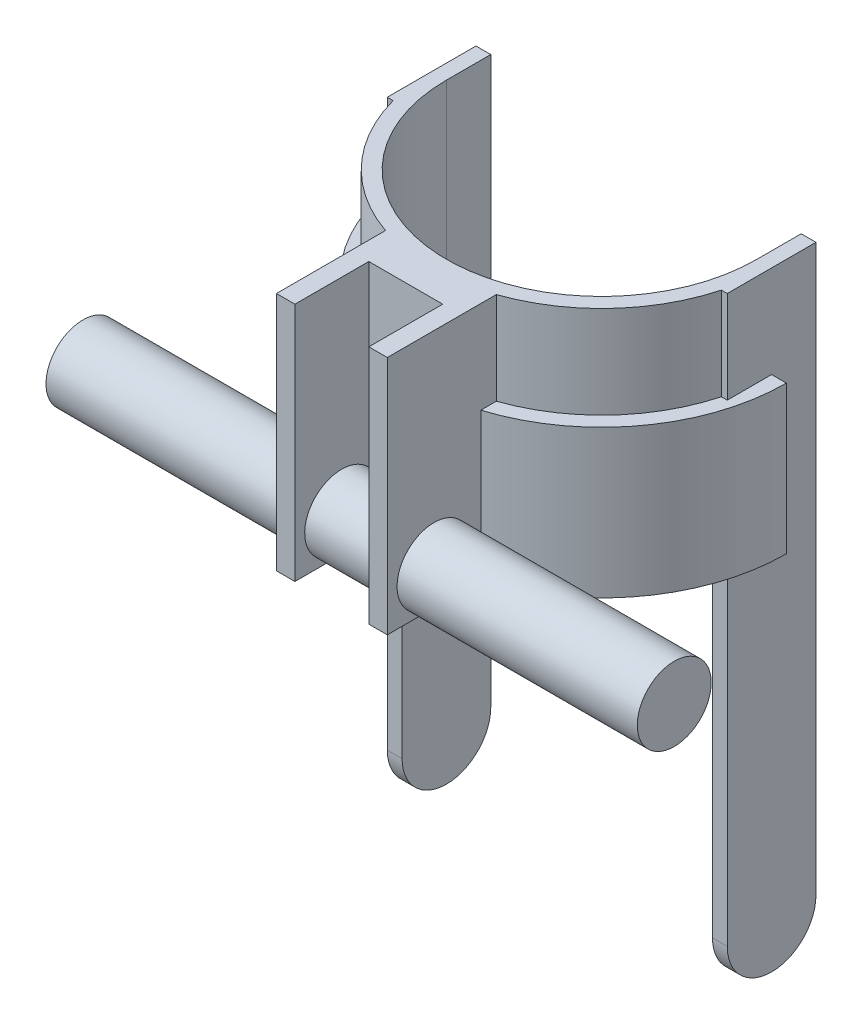
ISO-10303-21;
HEADER;
FILE_DESCRIPTION(('STEP AP214'),'2;1');
FILE_NAME('part.step','',(''),(''),'','','');
FILE_SCHEMA(('AUTOMOTIVE_DESIGN { 1 0 10303 214 1 1 1 1 }'));
ENDSEC;
DATA;
#1=APPLICATION_CONTEXT('core data for automotive mechanical design processes');
#2=APPLICATION_PROTOCOL_DEFINITION('international standard','automotive_design',2000,#1);
#3=PRODUCT_CONTEXT('',#1,'mechanical');
#4=PRODUCT('Part','Part','',(#3));
#5=PRODUCT_RELATED_PRODUCT_CATEGORY('part','',(#4));
#6=PRODUCT_DEFINITION_FORMATION('','',#4);
#7=PRODUCT_DEFINITION_CONTEXT('part definition',#1,'design');
#8=PRODUCT_DEFINITION('design','',#6,#7);
#9=PRODUCT_DEFINITION_SHAPE('','',#8);
#10=(LENGTH_UNIT() NAMED_UNIT(*) SI_UNIT(.MILLI.,.METRE.));
#11=(NAMED_UNIT(*) PLANE_ANGLE_UNIT() SI_UNIT($,.RADIAN.));
#12=(NAMED_UNIT(*) SI_UNIT($,.STERADIAN.) SOLID_ANGLE_UNIT());
#13=UNCERTAINTY_MEASURE_WITH_UNIT(LENGTH_MEASURE(1.E-05),#10,'distance_accuracy_value','');
#14=(GEOMETRIC_REPRESENTATION_CONTEXT(3) GLOBAL_UNCERTAINTY_ASSIGNED_CONTEXT((#13)) GLOBAL_UNIT_ASSIGNED_CONTEXT((#10,
#11,#12)) REPRESENTATION_CONTEXT('',''));
#15=CARTESIAN_POINT('',(0.,0.,0.));
#16=DIRECTION('',(0.,0.,1.));
#17=DIRECTION('',(1.,0.,0.));
#18=AXIS2_PLACEMENT_3D('',#15,#16,#17);
#19=CARTESIAN_POINT('',(-10.,50.,73.));
#20=DIRECTION('',(-1.,0.,0.));
#21=DIRECTION('',(0.,0.,1.));
#22=AXIS2_PLACEMENT_3D('',#19,#20,#21);
#23=PLANE('',#22);
#24=CARTESIAN_POINT('',(-9.99999999999999,-40.,60.3484800354236));
#25=DIRECTION('',(-1.,0.,0.));
#26=DIRECTION('',(0.,0.,1.));
#27=AXIS2_PLACEMENT_3D('',#24,#25,#26);
#28=CIRCLE('',#27,10.);
#29=CARTESIAN_POINT('',(-10.,-50.,60.3484800354236));
#30=VERTEX_POINT('',#29);
#31=CARTESIAN_POINT('',(-10.,-46.782318273937,53.));
#32=VERTEX_POINT('',#31);
#33=EDGE_CURVE('E625',#30,#32,#28,.F.);
#34=ORIENTED_EDGE('',*,*,#33,.F.);
#35=DIRECTION('',(0.,0.,-1.));
#36=VECTOR('',#35,1.);
#37=CARTESIAN_POINT('',(-10.,-50.,73.));
#38=LINE('',#37,#36);
#39=CARTESIAN_POINT('',(-10.,-50.,53.));
#40=VERTEX_POINT('',#39);
#41=EDGE_CURVE('E401',#30,#40,#38,.T.);
#42=ORIENTED_EDGE('',*,*,#41,.T.);
#43=DIRECTION('',(0.,-1.,0.));
#44=VECTOR('',#43,1.);
#45=CARTESIAN_POINT('',(-10.,50.,53.));
#46=LINE('',#45,#44);
#47=EDGE_CURVE('E310',#32,#40,#46,.T.);
#48=ORIENTED_EDGE('',*,*,#47,.F.);
#49=EDGE_LOOP('',(#34,#42,#48));
#50=FACE_BOUND('',#49,.T.);
#51=ADVANCED_FACE('F39',(#50),#23,.F.);
#52=CARTESIAN_POINT('',(-10.,50.,53.));
#53=DIRECTION('',(0.,0.,-1.));
#54=DIRECTION('',(-1.,0.,0.));
#55=AXIS2_PLACEMENT_3D('',#52,#53,#54);
#56=PLANE('',#55);
#57=DIRECTION('',(-1.,0.,0.));
#58=VECTOR('',#57,1.);
#59=CARTESIAN_POINT('',(80.,-46.782318273937,53.));
#60=LINE('',#59,#58);
#61=CARTESIAN_POINT('',(9.99999999999999,-46.782318273937,53.));
#62=VERTEX_POINT('',#61);
#63=EDGE_CURVE('E55',#32,#62,#60,.F.);
#64=ORIENTED_EDGE('',*,*,#63,.F.);
#65=ORIENTED_EDGE('',*,*,#47,.T.);
#66=DIRECTION('',(1.,0.,0.));
#67=VECTOR('',#66,1.);
#68=CARTESIAN_POINT('',(-10.,-50.,53.));
#69=LINE('',#68,#67);
#70=CARTESIAN_POINT('',(10.,-50.,53.));
#71=VERTEX_POINT('',#70);
#72=EDGE_CURVE('E405',#40,#71,#69,.T.);
#73=ORIENTED_EDGE('',*,*,#72,.T.);
#74=DIRECTION('',(0.,-1.,0.));
#75=VECTOR('',#74,1.);
#76=CARTESIAN_POINT('',(10.,50.,53.));
#77=LINE('',#76,#75);
#78=EDGE_CURVE('E306',#62,#71,#77,.T.);
#79=ORIENTED_EDGE('',*,*,#78,.F.);
#80=EDGE_LOOP('',(#64,#65,#73,#79));
#81=FACE_BOUND('',#80,.T.);
#82=ADVANCED_FACE('F664',(#81),#56,.F.);
#83=DIRECTION('',(-1.,0.,0.));
#84=VECTOR('',#83,1.);
#85=CARTESIAN_POINT('',(80.,-33.217681726063,53.));
#86=LINE('',#85,#84);
#87=CARTESIAN_POINT('',(9.99999999999999,-33.217681726063,53.));
#88=VERTEX_POINT('',#87);
#89=CARTESIAN_POINT('',(-10.,-33.217681726063,53.));
#90=VERTEX_POINT('',#89);
#91=EDGE_CURVE('E628',#88,#90,#86,.T.);
#92=ORIENTED_EDGE('',*,*,#91,.F.);
#93=CARTESIAN_POINT('',(10.,15.,53.));
#94=VERTEX_POINT('',#93);
#95=EDGE_CURVE('E307',#94,#88,#77,.T.);
#96=ORIENTED_EDGE('',*,*,#95,.F.);
#97=DIRECTION('',(-1.,0.,0.));
#98=VECTOR('',#97,1.);
#99=CARTESIAN_POINT('',(-10.,15.,53.));
#100=LINE('',#99,#98);
#101=CARTESIAN_POINT('',(-10.,15.,53.));
#102=VERTEX_POINT('',#101);
#103=EDGE_CURVE('E465',#94,#102,#100,.T.);
#104=ORIENTED_EDGE('',*,*,#103,.T.);
#105=EDGE_CURVE('E311',#102,#90,#46,.T.);
#106=ORIENTED_EDGE('',*,*,#105,.T.);
#107=EDGE_LOOP('',(#92,#96,#104,#106));
#108=FACE_BOUND('',#107,.T.);
#109=ADVANCED_FACE('F671',(#108),#56,.F.);
#110=CARTESIAN_POINT('',(10.,50.,73.));
#111=DIRECTION('',(1.,0.,0.));
#112=DIRECTION('',(0.,0.,-1.));
#113=AXIS2_PLACEMENT_3D('',#110,#111,#112);
#114=PLANE('',#113);
#115=CARTESIAN_POINT('',(9.99999999999999,-40.,60.3484800354236));
#116=DIRECTION('',(1.,0.,0.));
#117=DIRECTION('',(0.,0.,-1.));
#118=AXIS2_PLACEMENT_3D('',#115,#116,#117);
#119=CIRCLE('',#118,10.);
#120=CARTESIAN_POINT('',(10.,-50.,60.3484800354236));
#121=VERTEX_POINT('',#120);
#122=EDGE_CURVE('E618',#62,#121,#119,.F.);
#123=ORIENTED_EDGE('',*,*,#122,.F.);
#124=ORIENTED_EDGE('',*,*,#78,.T.);
#125=DIRECTION('',(0.,0.,1.));
#126=VECTOR('',#125,1.);
#127=CARTESIAN_POINT('',(10.,-50.,73.));
#128=LINE('',#127,#126);
#129=EDGE_CURVE('E277',#71,#121,#128,.T.);
#130=ORIENTED_EDGE('',*,*,#129,.T.);
#131=EDGE_LOOP('',(#123,#124,#130));
#132=FACE_BOUND('',#131,.T.);
#133=ADVANCED_FACE('F681',(#132),#114,.F.);
#134=CARTESIAN_POINT('',(-46.,50.,0.));
#135=DIRECTION('',(1.,0.,0.));
#136=DIRECTION('',(0.,0.,-1.));
#137=AXIS2_PLACEMENT_3D('',#134,#135,#136);
#138=PLANE('',#137);
#139=DIRECTION('',(0.,0.,-1.));
#140=VECTOR('',#139,1.);
#141=CARTESIAN_POINT('',(-46.,-10.,0.));
#142=LINE('',#141,#140);
#143=CARTESIAN_POINT('',(-46.,-10.,12.));
#144=VERTEX_POINT('',#143);
#145=CARTESIAN_POINT('',(-46.,-10.,0.));
#146=VERTEX_POINT('',#145);
#147=EDGE_CURVE('E439',#144,#146,#142,.T.);
#148=ORIENTED_EDGE('',*,*,#147,.F.);
#149=DIRECTION('',(0.,1.,0.));
#150=VECTOR('',#149,1.);
#151=CARTESIAN_POINT('',(-46.,-160.,12.));
#152=LINE('',#151,#150);
#153=CARTESIAN_POINT('',(-46.,15.,12.));
#154=VERTEX_POINT('',#153);
#155=EDGE_CURVE('E373',#144,#154,#152,.T.);
#156=ORIENTED_EDGE('',*,*,#155,.T.);
#157=DIRECTION('',(0.,0.,-1.));
#158=VECTOR('',#157,1.);
#159=CARTESIAN_POINT('',(-46.,15.,0.));
#160=LINE('',#159,#158);
#161=CARTESIAN_POINT('',(-46.,15.,-12.));
#162=VERTEX_POINT('',#161);
#163=EDGE_CURVE('E484',#154,#162,#160,.T.);
#164=ORIENTED_EDGE('',*,*,#163,.T.);
#165=DIRECTION('',(0.,-1.,0.));
#166=VECTOR('',#165,1.);
#167=CARTESIAN_POINT('',(-46.,50.,-12.));
#168=LINE('',#167,#166);
#169=CARTESIAN_POINT('',(-46.,-138.,-12.));
#170=VERTEX_POINT('',#169);
#171=EDGE_CURVE('E325',#162,#170,#168,.T.);
#172=ORIENTED_EDGE('',*,*,#171,.T.);
#173=CARTESIAN_POINT('',(-46.,-138.,0.));
#174=DIRECTION('',(-1.,0.,0.));
#175=DIRECTION('',(0.,0.,-1.));
#176=AXIS2_PLACEMENT_3D('',#173,#174,#175);
#177=CIRCLE('',#176,12.);
#178=CARTESIAN_POINT('',(-46.,-138.,12.));
#179=VERTEX_POINT('',#178);
#180=EDGE_CURVE('E489',#170,#179,#177,.T.);
#181=ORIENTED_EDGE('',*,*,#180,.T.);
#182=CARTESIAN_POINT('',(-46.,-50.,12.));
#183=VERTEX_POINT('',#182);
#184=EDGE_CURVE('E386',#179,#183,#152,.T.);
#185=ORIENTED_EDGE('',*,*,#184,.T.);
#186=DIRECTION('',(0.,0.,-1.));
#187=VECTOR('',#186,1.);
#188=CARTESIAN_POINT('',(-46.,-50.,0.));
#189=LINE('',#188,#187);
#190=CARTESIAN_POINT('',(-46.,-50.,0.));
#191=VERTEX_POINT('',#190);
#192=EDGE_CURVE('E361',#183,#191,#189,.T.);
#193=ORIENTED_EDGE('',*,*,#192,.T.);
#194=DIRECTION('',(0.,-1.,0.));
#195=VECTOR('',#194,1.);
#196=CARTESIAN_POINT('',(-46.,-10.,0.));
#197=LINE('',#196,#195);
#198=EDGE_CURVE('E564',#146,#191,#197,.T.);
#199=ORIENTED_EDGE('',*,*,#198,.F.);
#200=EDGE_LOOP('',(#148,#156,#164,#172,#181,#185,#193,#199));
#201=FACE_BOUND('',#200,.T.);
#202=ADVANCED_FACE('F523',(#201),#138,.F.);
#203=CARTESIAN_POINT('',(46.,50.,0.));
#204=DIRECTION('',(-1.,0.,0.));
#205=DIRECTION('',(0.,0.,1.));
#206=AXIS2_PLACEMENT_3D('',#203,#204,#205);
#207=PLANE('',#206);
#208=DIRECTION('',(0.,0.,1.));
#209=VECTOR('',#208,1.);
#210=CARTESIAN_POINT('',(46.,-10.,0.));
#211=LINE('',#210,#209);
#212=CARTESIAN_POINT('',(46.,-10.,0.));
#213=VERTEX_POINT('',#212);
#214=CARTESIAN_POINT('',(46.,-10.,12.));
#215=VERTEX_POINT('',#214);
#216=EDGE_CURVE('E543',#213,#215,#211,.T.);
#217=ORIENTED_EDGE('',*,*,#216,.F.);
#218=DIRECTION('',(0.,-1.,0.));
#219=VECTOR('',#218,1.);
#220=CARTESIAN_POINT('',(46.,-10.,0.));
#221=LINE('',#220,#219);
#222=CARTESIAN_POINT('',(46.,-50.,0.));
#223=VERTEX_POINT('',#222);
#224=EDGE_CURVE('E359',#213,#223,#221,.T.);
#225=ORIENTED_EDGE('',*,*,#224,.T.);
#226=DIRECTION('',(0.,0.,1.));
#227=VECTOR('',#226,1.);
#228=CARTESIAN_POINT('',(46.,-50.,0.));
#229=LINE('',#228,#227);
#230=CARTESIAN_POINT('',(46.,-50.,12.));
#231=VERTEX_POINT('',#230);
#232=EDGE_CURVE('E346',#223,#231,#229,.T.);
#233=ORIENTED_EDGE('',*,*,#232,.T.);
#234=DIRECTION('',(0.,1.,0.));
#235=VECTOR('',#234,1.);
#236=CARTESIAN_POINT('',(46.,-160.,12.));
#237=LINE('',#236,#235);
#238=CARTESIAN_POINT('',(46.,-138.,12.));
#239=VERTEX_POINT('',#238);
#240=EDGE_CURVE('E357',#239,#231,#237,.T.);
#241=ORIENTED_EDGE('',*,*,#240,.F.);
#242=CARTESIAN_POINT('',(46.,-138.,0.));
#243=DIRECTION('',(-1.,0.,0.));
#244=DIRECTION('',(0.,0.,-1.));
#245=AXIS2_PLACEMENT_3D('',#242,#243,#244);
#246=CIRCLE('',#245,12.);
#247=CARTESIAN_POINT('',(46.,-138.,-12.));
#248=VERTEX_POINT('',#247);
#249=EDGE_CURVE('E488',#248,#239,#246,.T.);
#250=ORIENTED_EDGE('',*,*,#249,.F.);
#251=DIRECTION('',(0.,-1.,0.));
#252=VECTOR('',#251,1.);
#253=CARTESIAN_POINT('',(46.,50.,-12.));
#254=LINE('',#253,#252);
#255=CARTESIAN_POINT('',(46.,15.,-12.));
#256=VERTEX_POINT('',#255);
#257=EDGE_CURVE('E293',#256,#248,#254,.T.);
#258=ORIENTED_EDGE('',*,*,#257,.F.);
#259=DIRECTION('',(0.,0.,1.));
#260=VECTOR('',#259,1.);
#261=CARTESIAN_POINT('',(46.,15.,0.));
#262=LINE('',#261,#260);
#263=CARTESIAN_POINT('',(46.,15.,12.));
#264=VERTEX_POINT('',#263);
#265=EDGE_CURVE('E458',#256,#264,#262,.T.);
#266=ORIENTED_EDGE('',*,*,#265,.T.);
#267=EDGE_CURVE('E369',#215,#264,#237,.T.);
#268=ORIENTED_EDGE('',*,*,#267,.F.);
#269=EDGE_LOOP('',(#217,#225,#233,#241,#250,#258,#266,#268));
#270=FACE_BOUND('',#269,.T.);
#271=ADVANCED_FACE('F355',(#270),#207,.F.);
#272=CARTESIAN_POINT('',(-46.,-160.,12.));
#273=DIRECTION('',(0.,0.,1.));
#274=DIRECTION('',(1.,0.,0.));
#275=AXIS2_PLACEMENT_3D('',#272,#273,#274);
#276=PLANE('',#275);
#277=ORIENTED_EDGE('',*,*,#155,.F.);
#278=DIRECTION('',(1.,0.,0.));
#279=VECTOR('',#278,1.);
#280=CARTESIAN_POINT('',(-46.,-10.,12.));
#281=LINE('',#280,#279);
#282=CARTESIAN_POINT('',(-44.407206622349,-10.,12.));
#283=VERTEX_POINT('',#282);
#284=EDGE_CURVE('E546',#144,#283,#281,.T.);
#285=ORIENTED_EDGE('',*,*,#284,.T.);
#286=DIRECTION('',(0.,-1.,0.));
#287=VECTOR('',#286,1.);
#288=CARTESIAN_POINT('',(-44.407206622349,50.,12.));
#289=LINE('',#288,#287);
#290=CARTESIAN_POINT('',(-44.407206622349,15.,12.));
#291=VERTEX_POINT('',#290);
#292=EDGE_CURVE('E385',#291,#283,#289,.T.);
#293=ORIENTED_EDGE('',*,*,#292,.F.);
#294=DIRECTION('',(1.,0.,0.));
#295=VECTOR('',#294,1.);
#296=CARTESIAN_POINT('',(-46.,15.,12.));
#297=LINE('',#296,#295);
#298=EDGE_CURVE('E481',#154,#291,#297,.T.);
#299=ORIENTED_EDGE('',*,*,#298,.F.);
#300=EDGE_LOOP('',(#277,#285,#293,#299));
#301=FACE_BOUND('',#300,.T.);
#302=ADVANCED_FACE('F707',(#301),#276,.T.);
#303=CARTESIAN_POINT('',(46.,-160.,12.));
#304=DIRECTION('',(0.,0.,1.));
#305=DIRECTION('',(1.,0.,0.));
#306=AXIS2_PLACEMENT_3D('',#303,#304,#305);
#307=PLANE('',#306);
#308=DIRECTION('',(0.,-1.,0.));
#309=VECTOR('',#308,1.);
#310=CARTESIAN_POINT('',(44.407206622349,50.,12.));
#311=LINE('',#310,#309);
#312=CARTESIAN_POINT('',(44.407206622349,-10.,12.));
#313=VERTEX_POINT('',#312);
#314=CARTESIAN_POINT('',(44.407206622349,15.,12.));
#315=VERTEX_POINT('',#314);
#316=EDGE_CURVE('E368',#313,#315,#311,.F.);
#317=ORIENTED_EDGE('',*,*,#316,.F.);
#318=DIRECTION('',(1.,0.,0.));
#319=VECTOR('',#318,1.);
#320=CARTESIAN_POINT('',(46.,-10.,12.));
#321=LINE('',#320,#319);
#322=EDGE_CURVE('E540',#313,#215,#321,.T.);
#323=ORIENTED_EDGE('',*,*,#322,.T.);
#324=ORIENTED_EDGE('',*,*,#267,.T.);
#325=DIRECTION('',(1.,0.,0.));
#326=VECTOR('',#325,1.);
#327=CARTESIAN_POINT('',(46.,15.,12.));
#328=LINE('',#327,#326);
#329=EDGE_CURVE('E454',#315,#264,#328,.T.);
#330=ORIENTED_EDGE('',*,*,#329,.F.);
#331=EDGE_LOOP('',(#317,#323,#324,#330));
#332=FACE_BOUND('',#331,.T.);
#333=ADVANCED_FACE('F694',(#332),#307,.T.);
#334=CARTESIAN_POINT('',(0.,50.,0.));
#335=DIRECTION('',(0.,-1.,0.));
#336=DIRECTION('',(0.,0.,-1.));
#337=AXIS2_PLACEMENT_3D('',#334,#335,#336);
#338=CYLINDRICAL_SURFACE('',#337,46.);
#339=CARTESIAN_POINT('',(0.,-10.,0.));
#340=DIRECTION('',(0.,1.,0.));
#341=DIRECTION('',(0.,0.,-1.));
#342=AXIS2_PLACEMENT_3D('',#339,#340,#341);
#343=CIRCLE('',#342,46.);
#344=CARTESIAN_POINT('',(-15.,-10.,43.4856298103178));
#345=VERTEX_POINT('',#344);
#346=EDGE_CURVE('E573',#283,#345,#343,.T.);
#347=ORIENTED_EDGE('',*,*,#346,.T.);
#348=DIRECTION('',(0.,-1.,0.));
#349=VECTOR('',#348,1.);
#350=CARTESIAN_POINT('',(-15.,50.,43.4856298103178));
#351=LINE('',#350,#349);
#352=CARTESIAN_POINT('',(-15.,15.,43.4856298103178));
#353=VERTEX_POINT('',#352);
#354=EDGE_CURVE('E321',#353,#345,#351,.T.);
#355=ORIENTED_EDGE('',*,*,#354,.F.);
#356=CARTESIAN_POINT('',(0.,15.,0.));
#357=DIRECTION('',(0.,-1.,0.));
#358=DIRECTION('',(0.,0.,-1.));
#359=AXIS2_PLACEMENT_3D('',#356,#357,#358);
#360=CIRCLE('',#359,46.);
#361=EDGE_CURVE('E477',#353,#291,#360,.T.);
#362=ORIENTED_EDGE('',*,*,#361,.T.);
#363=ORIENTED_EDGE('',*,*,#292,.T.);
#364=EDGE_LOOP('',(#347,#355,#362,#363));
#365=FACE_BOUND('',#364,.T.);
#366=ADVANCED_FACE('F690',(#365),#338,.T.);
#367=CARTESIAN_POINT('',(0.,50.,0.));
#368=DIRECTION('',(0.,-1.,0.));
#369=DIRECTION('',(0.,0.,-1.));
#370=AXIS2_PLACEMENT_3D('',#367,#368,#369);
#371=CYLINDRICAL_SURFACE('',#370,46.);
#372=CARTESIAN_POINT('',(15.,-10.,43.4856298103178));
#373=VERTEX_POINT('',#372);
#374=EDGE_CURVE('E568',#373,#313,#343,.T.);
#375=ORIENTED_EDGE('',*,*,#374,.T.);
#376=ORIENTED_EDGE('',*,*,#316,.T.);
#377=CARTESIAN_POINT('',(0.,15.,0.));
#378=DIRECTION('',(0.,-1.,0.));
#379=DIRECTION('',(0.,0.,-1.));
#380=AXIS2_PLACEMENT_3D('',#377,#378,#379);
#381=CIRCLE('',#380,46.);
#382=CARTESIAN_POINT('',(15.,15.,43.4856298103178));
#383=VERTEX_POINT('',#382);
#384=EDGE_CURVE('E447',#315,#383,#381,.T.);
#385=ORIENTED_EDGE('',*,*,#384,.T.);
#386=DIRECTION('',(0.,-1.,0.));
#387=VECTOR('',#386,1.);
#388=CARTESIAN_POINT('',(15.,50.,43.4856298103178));
#389=LINE('',#388,#387);
#390=EDGE_CURVE('E296',#383,#373,#389,.T.);
#391=ORIENTED_EDGE('',*,*,#390,.T.);
#392=EDGE_LOOP('',(#375,#376,#385,#391));
#393=FACE_BOUND('',#392,.T.);
#394=ADVANCED_FACE('F693',(#393),#371,.T.);
#395=CARTESIAN_POINT('',(42.,50.,0.));
#396=DIRECTION('',(1.,0.,0.));
#397=DIRECTION('',(0.,0.,-1.));
#398=AXIS2_PLACEMENT_3D('',#395,#396,#397);
#399=PLANE('',#398);
#400=DIRECTION('',(0.,-1.,0.));
#401=VECTOR('',#400,1.);
#402=CARTESIAN_POINT('',(42.,50.,0.));
#403=LINE('',#402,#401);
#404=CARTESIAN_POINT('',(42.,15.,0.));
#405=VERTEX_POINT('',#404);
#406=CARTESIAN_POINT('',(42.,-50.,0.));
#407=VERTEX_POINT('',#406);
#408=EDGE_CURVE('E287',#405,#407,#403,.T.);
#409=ORIENTED_EDGE('',*,*,#408,.F.);
#410=DIRECTION('',(0.,0.,-1.));
#411=VECTOR('',#410,1.);
#412=CARTESIAN_POINT('',(42.,15.,0.));
#413=LINE('',#412,#411);
#414=CARTESIAN_POINT('',(42.,15.,-12.));
#415=VERTEX_POINT('',#414);
#416=EDGE_CURVE('E433',#405,#415,#413,.T.);
#417=ORIENTED_EDGE('',*,*,#416,.T.);
#418=DIRECTION('',(0.,-1.,0.));
#419=VECTOR('',#418,1.);
#420=CARTESIAN_POINT('',(42.,50.,-12.));
#421=LINE('',#420,#419);
#422=CARTESIAN_POINT('',(42.,-138.,-12.));
#423=VERTEX_POINT('',#422);
#424=EDGE_CURVE('E290',#415,#423,#421,.T.);
#425=ORIENTED_EDGE('',*,*,#424,.T.);
#426=CARTESIAN_POINT('',(42.,-138.,0.));
#427=DIRECTION('',(1.,0.,0.));
#428=DIRECTION('',(0.,0.,-1.));
#429=AXIS2_PLACEMENT_3D('',#426,#427,#428);
#430=CIRCLE('',#429,12.);
#431=CARTESIAN_POINT('',(42.,-138.,12.));
#432=VERTEX_POINT('',#431);
#433=EDGE_CURVE('E499',#423,#432,#430,.F.);
#434=ORIENTED_EDGE('',*,*,#433,.T.);
#435=DIRECTION('',(0.,1.,0.));
#436=VECTOR('',#435,1.);
#437=CARTESIAN_POINT('',(42.,-160.,12.));
#438=LINE('',#437,#436);
#439=CARTESIAN_POINT('',(42.,-50.,12.));
#440=VERTEX_POINT('',#439);
#441=EDGE_CURVE('E375',#432,#440,#438,.T.);
#442=ORIENTED_EDGE('',*,*,#441,.T.);
#443=DIRECTION('',(0.,0.,1.));
#444=VECTOR('',#443,1.);
#445=CARTESIAN_POINT('',(42.,-50.,0.));
#446=LINE('',#445,#444);
#447=EDGE_CURVE('E339',#407,#440,#446,.T.);
#448=ORIENTED_EDGE('',*,*,#447,.F.);
#449=EDGE_LOOP('',(#409,#417,#425,#434,#442,#448));
#450=FACE_BOUND('',#449,.T.);
#451=ADVANCED_FACE('F732',(#450),#399,.F.);
#452=DIRECTION('',(1.,0.,0.));
#453=VECTOR('',#452,1.);
#454=CARTESIAN_POINT('',(0.,-50.,12.));
#455=LINE('',#454,#453);
#456=CARTESIAN_POINT('',(-42.,-50.,12.));
#457=VERTEX_POINT('',#456);
#458=EDGE_CURVE('E331',#183,#457,#455,.T.);
#459=ORIENTED_EDGE('',*,*,#458,.F.);
#460=ORIENTED_EDGE('',*,*,#184,.F.);
#461=DIRECTION('',(1.,0.,0.));
#462=VECTOR('',#461,1.);
#463=CARTESIAN_POINT('',(-46.,-138.,12.));
#464=LINE('',#463,#462);
#465=CARTESIAN_POINT('',(-42.,-138.,12.));
#466=VERTEX_POINT('',#465);
#467=EDGE_CURVE('E501',#179,#466,#464,.T.);
#468=ORIENTED_EDGE('',*,*,#467,.T.);
#469=DIRECTION('',(0.,1.,0.));
#470=VECTOR('',#469,1.);
#471=CARTESIAN_POINT('',(-42.,-160.,12.));
#472=LINE('',#471,#470);
#473=EDGE_CURVE('E382',#466,#457,#472,.T.);
#474=ORIENTED_EDGE('',*,*,#473,.T.);
#475=EDGE_LOOP('',(#459,#460,#468,#474));
#476=FACE_BOUND('',#475,.T.);
#477=ADVANCED_FACE('F520',(#476),#276,.T.);
#478=ORIENTED_EDGE('',*,*,#240,.T.);
#479=DIRECTION('',(1.,0.,0.));
#480=VECTOR('',#479,1.);
#481=CARTESIAN_POINT('',(0.,-50.,12.));
#482=LINE('',#481,#480);
#483=EDGE_CURVE('E48',#440,#231,#482,.T.);
#484=ORIENTED_EDGE('',*,*,#483,.F.);
#485=ORIENTED_EDGE('',*,*,#441,.F.);
#486=EDGE_CURVE('E366',#432,#239,#464,.T.);
#487=ORIENTED_EDGE('',*,*,#486,.T.);
#488=EDGE_LOOP('',(#478,#484,#485,#487));
#489=FACE_BOUND('',#488,.T.);
#490=ADVANCED_FACE('F365',(#489),#307,.T.);
#491=CARTESIAN_POINT('',(-42.,50.,0.));
#492=DIRECTION('',(-1.,0.,0.));
#493=DIRECTION('',(0.,0.,1.));
#494=AXIS2_PLACEMENT_3D('',#491,#492,#493);
#495=PLANE('',#494);
#496=DIRECTION('',(0.,-1.,0.));
#497=VECTOR('',#496,1.);
#498=CARTESIAN_POINT('',(-42.,50.,-12.));
#499=LINE('',#498,#497);
#500=CARTESIAN_POINT('',(-42.,15.,-12.));
#501=VERTEX_POINT('',#500);
#502=CARTESIAN_POINT('',(-42.,-138.,-12.));
#503=VERTEX_POINT('',#502);
#504=EDGE_CURVE('E328',#501,#503,#499,.T.);
#505=ORIENTED_EDGE('',*,*,#504,.F.);
#506=DIRECTION('',(0.,0.,1.));
#507=VECTOR('',#506,1.);
#508=CARTESIAN_POINT('',(-42.,15.,0.));
#509=LINE('',#508,#507);
#510=CARTESIAN_POINT('',(-42.,15.,0.));
#511=VERTEX_POINT('',#510);
#512=EDGE_CURVE('E427',#501,#511,#509,.T.);
#513=ORIENTED_EDGE('',*,*,#512,.T.);
#514=DIRECTION('',(0.,-1.,0.));
#515=VECTOR('',#514,1.);
#516=CARTESIAN_POINT('',(-42.,50.,0.));
#517=LINE('',#516,#515);
#518=CARTESIAN_POINT('',(-42.,-50.,0.));
#519=VERTEX_POINT('',#518);
#520=EDGE_CURVE('E284',#511,#519,#517,.T.);
#521=ORIENTED_EDGE('',*,*,#520,.T.);
#522=DIRECTION('',(0.,0.,-1.));
#523=VECTOR('',#522,1.);
#524=CARTESIAN_POINT('',(-42.,-50.,0.));
#525=LINE('',#524,#523);
#526=EDGE_CURVE('E335',#457,#519,#525,.T.);
#527=ORIENTED_EDGE('',*,*,#526,.F.);
#528=ORIENTED_EDGE('',*,*,#473,.F.);
#529=CARTESIAN_POINT('',(-42.,-138.,0.));
#530=DIRECTION('',(-1.,0.,0.));
#531=DIRECTION('',(0.,0.,1.));
#532=AXIS2_PLACEMENT_3D('',#529,#530,#531);
#533=CIRCLE('',#532,12.);
#534=EDGE_CURVE('E378',#466,#503,#533,.F.);
#535=ORIENTED_EDGE('',*,*,#534,.T.);
#536=EDGE_LOOP('',(#505,#513,#521,#527,#528,#535));
#537=FACE_BOUND('',#536,.T.);
#538=ADVANCED_FACE('F41',(#537),#495,.F.);
#539=CARTESIAN_POINT('',(-46.,50.,-12.));
#540=DIRECTION('',(0.,0.,1.));
#541=DIRECTION('',(1.,0.,0.));
#542=AXIS2_PLACEMENT_3D('',#539,#540,#541);
#543=PLANE('',#542);
#544=ORIENTED_EDGE('',*,*,#171,.F.);
#545=DIRECTION('',(-1.,0.,0.));
#546=VECTOR('',#545,1.);
#547=CARTESIAN_POINT('',(70.7811360911674,15.,-12.));
#548=LINE('',#547,#546);
#549=EDGE_CURVE('E441',#501,#162,#548,.T.);
#550=ORIENTED_EDGE('',*,*,#549,.F.);
#551=ORIENTED_EDGE('',*,*,#504,.T.);
#552=DIRECTION('',(1.,0.,0.));
#553=VECTOR('',#552,1.);
#554=CARTESIAN_POINT('',(-46.,-138.,-12.));
#555=LINE('',#554,#553);
#556=EDGE_CURVE('E495',#170,#503,#555,.T.);
#557=ORIENTED_EDGE('',*,*,#556,.F.);
#558=EDGE_LOOP('',(#544,#550,#551,#557));
#559=FACE_BOUND('',#558,.T.);
#560=ADVANCED_FACE('F686',(#559),#543,.F.);
#561=CARTESIAN_POINT('',(-15.,50.,43.4856298103178));
#562=DIRECTION('',(1.,0.,0.));
#563=DIRECTION('',(0.,0.,-1.));
#564=AXIS2_PLACEMENT_3D('',#561,#562,#563);
#565=PLANE('',#564);
#566=DIRECTION('',(0.,0.,1.));
#567=VECTOR('',#566,1.);
#568=CARTESIAN_POINT('',(-15.,-50.,43.4856298103178));
#569=LINE('',#568,#567);
#570=CARTESIAN_POINT('',(-15.,-50.,47.6969600708473));
#571=VERTEX_POINT('',#570);
#572=CARTESIAN_POINT('',(-15.,-50.,60.3484800354236));
#573=VERTEX_POINT('',#572);
#574=EDGE_CURVE('E394',#571,#573,#569,.T.);
#575=ORIENTED_EDGE('',*,*,#574,.T.);
#576=CARTESIAN_POINT('',(-15.,-40.,60.3484800354236));
#577=DIRECTION('',(1.,0.,0.));
#578=DIRECTION('',(0.,0.,-1.));
#579=AXIS2_PLACEMENT_3D('',#576,#577,#578);
#580=CIRCLE('',#579,10.);
#581=EDGE_CURVE('E615',#573,#573,#580,.F.);
#582=ORIENTED_EDGE('',*,*,#581,.F.);
#583=CARTESIAN_POINT('',(-15.,-50.,73.));
#584=VERTEX_POINT('',#583);
#585=EDGE_CURVE('E393',#573,#584,#569,.T.);
#586=ORIENTED_EDGE('',*,*,#585,.T.);
#587=DIRECTION('',(0.,-1.,0.));
#588=VECTOR('',#587,1.);
#589=CARTESIAN_POINT('',(-15.,50.,73.));
#590=LINE('',#589,#588);
#591=CARTESIAN_POINT('',(-15.,15.,73.));
#592=VERTEX_POINT('',#591);
#593=EDGE_CURVE('E317',#592,#584,#590,.T.);
#594=ORIENTED_EDGE('',*,*,#593,.F.);
#595=DIRECTION('',(0.,0.,-1.));
#596=VECTOR('',#595,1.);
#597=CARTESIAN_POINT('',(-15.,15.,43.4856298103178));
#598=LINE('',#597,#596);
#599=EDGE_CURVE('E473',#592,#353,#598,.T.);
#600=ORIENTED_EDGE('',*,*,#599,.T.);
#601=ORIENTED_EDGE('',*,*,#354,.T.);
#602=DIRECTION('',(0.,0.,-1.));
#603=VECTOR('',#602,1.);
#604=CARTESIAN_POINT('',(-15.,-10.,43.4856298103178));
#605=LINE('',#604,#603);
#606=CARTESIAN_POINT('',(-15.,-10.,47.6969600708473));
#607=VERTEX_POINT('',#606);
#608=EDGE_CURVE('E533',#607,#345,#605,.T.);
#609=ORIENTED_EDGE('',*,*,#608,.F.);
#610=DIRECTION('',(0.,-1.,0.));
#611=VECTOR('',#610,1.);
#612=CARTESIAN_POINT('',(-15.,-10.,47.6969600708473));
#613=LINE('',#612,#611);
#614=EDGE_CURVE('E362',#607,#571,#613,.T.);
#615=ORIENTED_EDGE('',*,*,#614,.T.);
#616=EDGE_LOOP('',(#575,#582,#586,#594,#600,#601,#609,#615));
#617=FACE_BOUND('',#616,.T.);
#618=ADVANCED_FACE('F607',(#617),#565,.F.);
#619=CARTESIAN_POINT('',(-15.,50.,73.));
#620=DIRECTION('',(0.,0.,-1.));
#621=DIRECTION('',(-1.,0.,0.));
#622=AXIS2_PLACEMENT_3D('',#619,#620,#621);
#623=PLANE('',#622);
#624=DIRECTION('',(0.,-1.,0.));
#625=VECTOR('',#624,1.);
#626=CARTESIAN_POINT('',(-10.,50.,73.));
#627=LINE('',#626,#625);
#628=CARTESIAN_POINT('',(-9.99999999999999,15.,73.));
#629=VERTEX_POINT('',#628);
#630=CARTESIAN_POINT('',(-10.,-50.,73.));
#631=VERTEX_POINT('',#630);
#632=EDGE_CURVE('E314',#629,#631,#627,.T.);
#633=ORIENTED_EDGE('',*,*,#632,.F.);
#634=DIRECTION('',(-1.,0.,0.));
#635=VECTOR('',#634,1.);
#636=CARTESIAN_POINT('',(70.7811360911674,15.,73.));
#637=LINE('',#636,#635);
#638=EDGE_CURVE('E428',#629,#592,#637,.T.);
#639=ORIENTED_EDGE('',*,*,#638,.T.);
#640=ORIENTED_EDGE('',*,*,#593,.T.);
#641=DIRECTION('',(1.,0.,0.));
#642=VECTOR('',#641,1.);
#643=CARTESIAN_POINT('',(-15.,-50.,73.));
#644=LINE('',#643,#642);
#645=EDGE_CURVE('E397',#584,#631,#644,.T.);
#646=ORIENTED_EDGE('',*,*,#645,.T.);
#647=EDGE_LOOP('',(#633,#639,#640,#646));
#648=FACE_BOUND('',#647,.T.);
#649=ADVANCED_FACE('F675',(#648),#623,.F.);
#650=EDGE_CURVE('E63',#90,#30,#28,.F.);
#651=ORIENTED_EDGE('',*,*,#650,.F.);
#652=ORIENTED_EDGE('',*,*,#105,.F.);
#653=DIRECTION('',(0.,0.,1.));
#654=VECTOR('',#653,1.);
#655=CARTESIAN_POINT('',(-10.,15.,73.));
#656=LINE('',#655,#654);
#657=EDGE_CURVE('E469',#102,#629,#656,.T.);
#658=ORIENTED_EDGE('',*,*,#657,.T.);
#659=ORIENTED_EDGE('',*,*,#632,.T.);
#660=EDGE_CURVE('E402',#631,#30,#38,.T.);
#661=ORIENTED_EDGE('',*,*,#660,.T.);
#662=EDGE_LOOP('',(#651,#652,#658,#659,#661));
#663=FACE_BOUND('',#662,.T.);
#664=ADVANCED_FACE('F667',(#663),#23,.F.);
#665=EDGE_CURVE('E420',#121,#88,#119,.F.);
#666=ORIENTED_EDGE('',*,*,#665,.F.);
#667=CARTESIAN_POINT('',(10.,-50.,73.));
#668=VERTEX_POINT('',#667);
#669=EDGE_CURVE('E408',#121,#668,#128,.T.);
#670=ORIENTED_EDGE('',*,*,#669,.T.);
#671=DIRECTION('',(0.,-1.,0.));
#672=VECTOR('',#671,1.);
#673=CARTESIAN_POINT('',(10.,50.,73.));
#674=LINE('',#673,#672);
#675=CARTESIAN_POINT('',(10.,15.,73.));
#676=VERTEX_POINT('',#675);
#677=EDGE_CURVE('E302',#676,#668,#674,.T.);
#678=ORIENTED_EDGE('',*,*,#677,.F.);
#679=DIRECTION('',(0.,0.,-1.));
#680=VECTOR('',#679,1.);
#681=CARTESIAN_POINT('',(10.,15.,73.));
#682=LINE('',#681,#680);
#683=EDGE_CURVE('E462',#676,#94,#682,.T.);
#684=ORIENTED_EDGE('',*,*,#683,.T.);
#685=ORIENTED_EDGE('',*,*,#95,.T.);
#686=EDGE_LOOP('',(#666,#670,#678,#684,#685));
#687=FACE_BOUND('',#686,.T.);
#688=ADVANCED_FACE('F417',(#687),#114,.F.);
#689=CARTESIAN_POINT('',(10.,50.,73.));
#690=DIRECTION('',(0.,0.,-1.));
#691=DIRECTION('',(-1.,0.,0.));
#692=AXIS2_PLACEMENT_3D('',#689,#690,#691);
#693=PLANE('',#692);
#694=DIRECTION('',(0.,-1.,0.));
#695=VECTOR('',#694,1.);
#696=CARTESIAN_POINT('',(15.,50.,73.));
#697=LINE('',#696,#695);
#698=CARTESIAN_POINT('',(15.,15.,73.));
#699=VERTEX_POINT('',#698);
#700=CARTESIAN_POINT('',(15.,-50.,73.));
#701=VERTEX_POINT('',#700);
#702=EDGE_CURVE('E259',#699,#701,#697,.T.);
#703=ORIENTED_EDGE('',*,*,#702,.F.);
#704=EDGE_CURVE('E424',#699,#676,#637,.T.);
#705=ORIENTED_EDGE('',*,*,#704,.T.);
#706=ORIENTED_EDGE('',*,*,#677,.T.);
#707=DIRECTION('',(1.,0.,0.));
#708=VECTOR('',#707,1.);
#709=CARTESIAN_POINT('',(10.,-50.,73.));
#710=LINE('',#709,#708);
#711=EDGE_CURVE('E275',#668,#701,#710,.T.);
#712=ORIENTED_EDGE('',*,*,#711,.T.);
#713=EDGE_LOOP('',(#703,#705,#706,#712));
#714=FACE_BOUND('',#713,.T.);
#715=ADVANCED_FACE('F423',(#714),#693,.F.);
#716=CARTESIAN_POINT('',(15.,50.,43.4856298103178));
#717=DIRECTION('',(-1.,0.,0.));
#718=DIRECTION('',(0.,0.,1.));
#719=AXIS2_PLACEMENT_3D('',#716,#717,#718);
#720=PLANE('',#719);
#721=DIRECTION('',(0.,0.,-1.));
#722=VECTOR('',#721,1.);
#723=CARTESIAN_POINT('',(15.,-50.,43.4856298103178));
#724=LINE('',#723,#722);
#725=CARTESIAN_POINT('',(15.,-50.,60.3484800354236));
#726=VERTEX_POINT('',#725);
#727=EDGE_CURVE('E252',#701,#726,#724,.T.);
#728=ORIENTED_EDGE('',*,*,#727,.T.);
#729=CARTESIAN_POINT('',(15.,-40.,60.3484800354236));
#730=DIRECTION('',(-1.,0.,0.));
#731=DIRECTION('',(0.,0.,1.));
#732=AXIS2_PLACEMENT_3D('',#729,#730,#731);
#733=CIRCLE('',#732,10.);
#734=EDGE_CURVE('E256',#726,#726,#733,.F.);
#735=ORIENTED_EDGE('',*,*,#734,.F.);
#736=CARTESIAN_POINT('',(15.,-50.,47.6969600708473));
#737=VERTEX_POINT('',#736);
#738=EDGE_CURVE('E265',#726,#737,#724,.T.);
#739=ORIENTED_EDGE('',*,*,#738,.T.);
#740=DIRECTION('',(0.,-1.,0.));
#741=VECTOR('',#740,1.);
#742=CARTESIAN_POINT('',(15.,-10.,47.6969600708473));
#743=LINE('',#742,#741);
#744=CARTESIAN_POINT('',(15.,-10.,47.6969600708473));
#745=VERTEX_POINT('',#744);
#746=EDGE_CURVE('E595',#737,#745,#743,.F.);
#747=ORIENTED_EDGE('',*,*,#746,.T.);
#748=DIRECTION('',(0.,0.,1.));
#749=VECTOR('',#748,1.);
#750=CARTESIAN_POINT('',(15.,-10.,43.4856298103178));
#751=LINE('',#750,#749);
#752=EDGE_CURVE('E529',#373,#745,#751,.T.);
#753=ORIENTED_EDGE('',*,*,#752,.F.);
#754=ORIENTED_EDGE('',*,*,#390,.F.);
#755=DIRECTION('',(0.,0.,1.));
#756=VECTOR('',#755,1.);
#757=CARTESIAN_POINT('',(15.,15.,43.4856298103178));
#758=LINE('',#757,#756);
#759=EDGE_CURVE('E451',#383,#699,#758,.T.);
#760=ORIENTED_EDGE('',*,*,#759,.T.);
#761=ORIENTED_EDGE('',*,*,#702,.T.);
#762=EDGE_LOOP('',(#728,#735,#739,#747,#753,#754,#760,#761));
#763=FACE_BOUND('',#762,.T.);
#764=ADVANCED_FACE('F254',(#763),#720,.F.);
#765=CARTESIAN_POINT('',(46.,50.,-12.));
#766=DIRECTION('',(0.,0.,1.));
#767=DIRECTION('',(1.,0.,0.));
#768=AXIS2_PLACEMENT_3D('',#765,#766,#767);
#769=PLANE('',#768);
#770=ORIENTED_EDGE('',*,*,#424,.F.);
#771=EDGE_CURVE('E436',#256,#415,#548,.T.);
#772=ORIENTED_EDGE('',*,*,#771,.F.);
#773=ORIENTED_EDGE('',*,*,#257,.T.);
#774=EDGE_CURVE('E500',#423,#248,#555,.T.);
#775=ORIENTED_EDGE('',*,*,#774,.F.);
#776=EDGE_LOOP('',(#770,#772,#773,#775));
#777=FACE_BOUND('',#776,.T.);
#778=ADVANCED_FACE('F729',(#777),#769,.F.);
#779=CARTESIAN_POINT('',(0.,50.,0.));
#780=DIRECTION('',(0.,-1.,0.));
#781=DIRECTION('',(0.,0.,-1.));
#782=AXIS2_PLACEMENT_3D('',#779,#780,#781);
#783=CYLINDRICAL_SURFACE('',#782,42.);
#784=ORIENTED_EDGE('',*,*,#520,.F.);
#785=CARTESIAN_POINT('',(0.,15.,0.));
#786=DIRECTION('',(0.,-1.,0.));
#787=DIRECTION('',(0.,0.,-1.));
#788=AXIS2_PLACEMENT_3D('',#785,#786,#787);
#789=CIRCLE('',#788,42.);
#790=EDGE_CURVE('E11',#511,#405,#789,.F.);
#791=ORIENTED_EDGE('',*,*,#790,.T.);
#792=ORIENTED_EDGE('',*,*,#408,.T.);
#793=CARTESIAN_POINT('',(0.,-50.,0.));
#794=DIRECTION('',(0.,-1.,0.));
#795=DIRECTION('',(0.,0.,1.));
#796=AXIS2_PLACEMENT_3D('',#793,#794,#795);
#797=CIRCLE('',#796,42.);
#798=EDGE_CURVE('E264',#407,#519,#797,.T.);
#799=ORIENTED_EDGE('',*,*,#798,.T.);
#800=EDGE_LOOP('',(#784,#791,#792,#799));
#801=FACE_BOUND('',#800,.T.);
#802=ADVANCED_FACE('F738',(#801),#783,.F.);
#803=CARTESIAN_POINT('',(0.,-50.,0.));
#804=DIRECTION('',(0.,1.,0.));
#805=DIRECTION('',(0.,0.,1.));
#806=AXIS2_PLACEMENT_3D('',#803,#804,#805);
#807=PLANE('',#806);
#808=ORIENTED_EDGE('',*,*,#669,.F.);
#809=ORIENTED_EDGE('',*,*,#129,.F.);
#810=ORIENTED_EDGE('',*,*,#72,.F.);
#811=ORIENTED_EDGE('',*,*,#41,.F.);
#812=ORIENTED_EDGE('',*,*,#660,.F.);
#813=ORIENTED_EDGE('',*,*,#645,.F.);
#814=ORIENTED_EDGE('',*,*,#585,.F.);
#815=ORIENTED_EDGE('',*,*,#574,.F.);
#816=CARTESIAN_POINT('',(0.,-50.,0.));
#817=DIRECTION('',(0.,-1.,0.));
#818=DIRECTION('',(0.,0.,-1.));
#819=AXIS2_PLACEMENT_3D('',#816,#817,#818);
#820=CIRCLE('',#819,50.);
#821=CARTESIAN_POINT('',(-50.,-50.,0.));
#822=VERTEX_POINT('',#821);
#823=EDGE_CURVE('E586',#571,#822,#820,.T.);
#824=ORIENTED_EDGE('',*,*,#823,.T.);
#825=DIRECTION('',(1.,0.,0.));
#826=VECTOR('',#825,1.);
#827=CARTESIAN_POINT('',(-50.,-50.,0.));
#828=LINE('',#827,#826);
#829=EDGE_CURVE('E527',#822,#191,#828,.T.);
#830=ORIENTED_EDGE('',*,*,#829,.T.);
#831=ORIENTED_EDGE('',*,*,#192,.F.);
#832=ORIENTED_EDGE('',*,*,#458,.T.);
#833=ORIENTED_EDGE('',*,*,#526,.T.);
#834=ORIENTED_EDGE('',*,*,#798,.F.);
#835=ORIENTED_EDGE('',*,*,#447,.T.);
#836=ORIENTED_EDGE('',*,*,#483,.T.);
#837=ORIENTED_EDGE('',*,*,#232,.F.);
#838=DIRECTION('',(1.,0.,0.));
#839=VECTOR('',#838,1.);
#840=CARTESIAN_POINT('',(46.,-50.,0.));
#841=LINE('',#840,#839);
#842=CARTESIAN_POINT('',(50.,-50.,0.));
#843=VERTEX_POINT('',#842);
#844=EDGE_CURVE('E589',#223,#843,#841,.T.);
#845=ORIENTED_EDGE('',*,*,#844,.T.);
#846=EDGE_CURVE('E272',#843,#737,#820,.T.);
#847=ORIENTED_EDGE('',*,*,#846,.T.);
#848=ORIENTED_EDGE('',*,*,#738,.F.);
#849=ORIENTED_EDGE('',*,*,#727,.F.);
#850=ORIENTED_EDGE('',*,*,#711,.F.);
#851=EDGE_LOOP('',(#808,#809,#810,#811,#812,#813,#814,#815,#824,#830,#831,#832,#833,#834,#835,
#836,#837,#845,#847,#848,#849,#850));
#852=FACE_BOUND('',#851,.T.);
#853=ADVANCED_FACE('F269',(#852),#807,.F.);
#854=CARTESIAN_POINT('',(-46.,-138.,0.));
#855=DIRECTION('',(1.,0.,0.));
#856=DIRECTION('',(0.,0.,-1.));
#857=AXIS2_PLACEMENT_3D('',#854,#855,#856);
#858=CYLINDRICAL_SURFACE('',#857,12.);
#859=ORIENTED_EDGE('',*,*,#774,.T.);
#860=ORIENTED_EDGE('',*,*,#249,.T.);
#861=ORIENTED_EDGE('',*,*,#486,.F.);
#862=ORIENTED_EDGE('',*,*,#433,.F.);
#863=EDGE_LOOP('',(#859,#860,#861,#862));
#864=FACE_BOUND('',#863,.T.);
#865=ADVANCED_FACE('F747',(#864),#858,.T.);
#866=ORIENTED_EDGE('',*,*,#467,.F.);
#867=ORIENTED_EDGE('',*,*,#180,.F.);
#868=ORIENTED_EDGE('',*,*,#556,.T.);
#869=ORIENTED_EDGE('',*,*,#534,.F.);
#870=EDGE_LOOP('',(#866,#867,#868,#869));
#871=FACE_BOUND('',#870,.T.);
#872=ADVANCED_FACE('F515',(#871),#858,.T.);
#873=CARTESIAN_POINT('',(70.7811360911674,15.,73.));
#874=DIRECTION('',(0.,-1.,0.));
#875=DIRECTION('',(0.,0.,-1.));
#876=AXIS2_PLACEMENT_3D('',#873,#874,#875);
#877=PLANE('',#876);
#878=ORIENTED_EDGE('',*,*,#298,.T.);
#879=ORIENTED_EDGE('',*,*,#361,.F.);
#880=ORIENTED_EDGE('',*,*,#599,.F.);
#881=ORIENTED_EDGE('',*,*,#638,.F.);
#882=ORIENTED_EDGE('',*,*,#657,.F.);
#883=ORIENTED_EDGE('',*,*,#103,.F.);
#884=ORIENTED_EDGE('',*,*,#683,.F.);
#885=ORIENTED_EDGE('',*,*,#704,.F.);
#886=ORIENTED_EDGE('',*,*,#759,.F.);
#887=ORIENTED_EDGE('',*,*,#384,.F.);
#888=ORIENTED_EDGE('',*,*,#329,.T.);
#889=ORIENTED_EDGE('',*,*,#265,.F.);
#890=ORIENTED_EDGE('',*,*,#771,.T.);
#891=ORIENTED_EDGE('',*,*,#416,.F.);
#892=ORIENTED_EDGE('',*,*,#790,.F.);
#893=ORIENTED_EDGE('',*,*,#512,.F.);
#894=ORIENTED_EDGE('',*,*,#549,.T.);
#895=ORIENTED_EDGE('',*,*,#163,.F.);
#896=EDGE_LOOP('',(#878,#879,#880,#881,#882,#883,#884,#885,#886,#887,#888,#889,#890,#891,#892,
#893,#894,#895));
#897=FACE_BOUND('',#896,.T.);
#898=ADVANCED_FACE('F706',(#897),#877,.F.);
#899=CARTESIAN_POINT('',(0.,-10.,0.));
#900=DIRECTION('',(0.,-1.,0.));
#901=DIRECTION('',(0.,0.,-1.));
#902=AXIS2_PLACEMENT_3D('',#899,#900,#901);
#903=PLANE('',#902);
#904=DIRECTION('',(1.,0.,0.));
#905=VECTOR('',#904,1.);
#906=CARTESIAN_POINT('',(46.,-10.,0.));
#907=LINE('',#906,#905);
#908=CARTESIAN_POINT('',(50.,-10.,0.));
#909=VERTEX_POINT('',#908);
#910=EDGE_CURVE('E580',#213,#909,#907,.T.);
#911=ORIENTED_EDGE('',*,*,#910,.F.);
#912=ORIENTED_EDGE('',*,*,#216,.T.);
#913=ORIENTED_EDGE('',*,*,#322,.F.);
#914=ORIENTED_EDGE('',*,*,#374,.F.);
#915=ORIENTED_EDGE('',*,*,#752,.T.);
#916=CARTESIAN_POINT('',(0.,-10.,0.));
#917=DIRECTION('',(0.,-1.,0.));
#918=DIRECTION('',(0.,0.,-1.));
#919=AXIS2_PLACEMENT_3D('',#916,#917,#918);
#920=CIRCLE('',#919,50.);
#921=EDGE_CURVE('E569',#909,#745,#920,.T.);
#922=ORIENTED_EDGE('',*,*,#921,.F.);
#923=EDGE_LOOP('',(#911,#912,#913,#914,#915,#922));
#924=FACE_BOUND('',#923,.T.);
#925=ADVANCED_FACE('F756',(#924),#903,.F.);
#926=CARTESIAN_POINT('',(0.,-10.,0.));
#927=DIRECTION('',(0.,-1.,0.));
#928=DIRECTION('',(0.,0.,-1.));
#929=AXIS2_PLACEMENT_3D('',#926,#927,#928);
#930=CYLINDRICAL_SURFACE('',#929,50.);
#931=ORIENTED_EDGE('',*,*,#746,.F.);
#932=ORIENTED_EDGE('',*,*,#846,.F.);
#933=DIRECTION('',(0.,-1.,0.));
#934=VECTOR('',#933,1.);
#935=CARTESIAN_POINT('',(50.,-10.,0.));
#936=LINE('',#935,#934);
#937=EDGE_CURVE('E592',#909,#843,#936,.T.);
#938=ORIENTED_EDGE('',*,*,#937,.F.);
#939=ORIENTED_EDGE('',*,*,#921,.T.);
#940=EDGE_LOOP('',(#931,#932,#938,#939));
#941=FACE_BOUND('',#940,.T.);
#942=ADVANCED_FACE('F759',(#941),#930,.T.);
#943=CARTESIAN_POINT('',(46.,-10.,0.));
#944=DIRECTION('',(0.,0.,-1.));
#945=DIRECTION('',(-1.,0.,0.));
#946=AXIS2_PLACEMENT_3D('',#943,#944,#945);
#947=PLANE('',#946);
#948=ORIENTED_EDGE('',*,*,#844,.F.);
#949=ORIENTED_EDGE('',*,*,#224,.F.);
#950=ORIENTED_EDGE('',*,*,#910,.T.);
#951=ORIENTED_EDGE('',*,*,#937,.T.);
#952=EDGE_LOOP('',(#948,#949,#950,#951));
#953=FACE_BOUND('',#952,.T.);
#954=ADVANCED_FACE('F762',(#953),#947,.T.);
#955=ORIENTED_EDGE('',*,*,#284,.F.);
#956=ORIENTED_EDGE('',*,*,#147,.T.);
#957=DIRECTION('',(1.,0.,0.));
#958=VECTOR('',#957,1.);
#959=CARTESIAN_POINT('',(-50.,-10.,0.));
#960=LINE('',#959,#958);
#961=CARTESIAN_POINT('',(-50.,-10.,0.));
#962=VERTEX_POINT('',#961);
#963=EDGE_CURVE('E559',#962,#146,#960,.T.);
#964=ORIENTED_EDGE('',*,*,#963,.F.);
#965=EDGE_CURVE('E576',#607,#962,#920,.T.);
#966=ORIENTED_EDGE('',*,*,#965,.F.);
#967=ORIENTED_EDGE('',*,*,#608,.T.);
#968=ORIENTED_EDGE('',*,*,#346,.F.);
#969=EDGE_LOOP('',(#955,#956,#964,#966,#967,#968));
#970=FACE_BOUND('',#969,.T.);
#971=ADVANCED_FACE('F557',(#970),#903,.F.);
#972=ORIENTED_EDGE('',*,*,#614,.F.);
#973=ORIENTED_EDGE('',*,*,#965,.T.);
#974=DIRECTION('',(0.,-1.,0.));
#975=VECTOR('',#974,1.);
#976=CARTESIAN_POINT('',(-50.,-10.,0.));
#977=LINE('',#976,#975);
#978=EDGE_CURVE('E566',#962,#822,#977,.T.);
#979=ORIENTED_EDGE('',*,*,#978,.T.);
#980=ORIENTED_EDGE('',*,*,#823,.F.);
#981=EDGE_LOOP('',(#972,#973,#979,#980));
#982=FACE_BOUND('',#981,.T.);
#983=ADVANCED_FACE('F613',(#982),#930,.T.);
#984=CARTESIAN_POINT('',(-50.,-10.,0.));
#985=DIRECTION('',(0.,0.,-1.));
#986=DIRECTION('',(-1.,0.,0.));
#987=AXIS2_PLACEMENT_3D('',#984,#985,#986);
#988=PLANE('',#987);
#989=ORIENTED_EDGE('',*,*,#829,.F.);
#990=ORIENTED_EDGE('',*,*,#978,.F.);
#991=ORIENTED_EDGE('',*,*,#963,.T.);
#992=ORIENTED_EDGE('',*,*,#198,.T.);
#993=EDGE_LOOP('',(#989,#990,#991,#992));
#994=FACE_BOUND('',#993,.T.);
#995=ADVANCED_FACE('F563',(#994),#988,.T.);
#996=CARTESIAN_POINT('',(80.,-40.,60.3484800354236));
#997=DIRECTION('',(1.,0.,0.));
#998=DIRECTION('',(0.,0.,-1.));
#999=AXIS2_PLACEMENT_3D('',#996,#997,#998);
#1000=PLANE('',#999);
#1001=CARTESIAN_POINT('',(80.,-40.,60.3484800354236));
#1002=DIRECTION('',(1.,0.,0.));
#1003=DIRECTION('',(0.,0.,-1.));
#1004=AXIS2_PLACEMENT_3D('',#1001,#1002,#1003);
#1005=CIRCLE('',#1004,10.);
#1006=CARTESIAN_POINT('',(80.,-40.,50.3484800354236));
#1007=VERTEX_POINT('',#1006);
#1008=EDGE_CURVE('E635',#1007,#1007,#1005,.T.);
#1009=ORIENTED_EDGE('',*,*,#1008,.T.);
#1010=EDGE_LOOP('',(#1009));
#1011=FACE_BOUND('',#1010,.T.);
#1012=ADVANCED_FACE('F644',(#1011),#1000,.T.);
#1013=CARTESIAN_POINT('',(80.,-40.,60.3484800354236));
#1014=DIRECTION('',(-1.,0.,0.));
#1015=DIRECTION('',(0.,0.,1.));
#1016=AXIS2_PLACEMENT_3D('',#1013,#1014,#1015);
#1017=CYLINDRICAL_SURFACE('',#1016,10.);
#1018=ORIENTED_EDGE('',*,*,#1008,.F.);
#1019=EDGE_LOOP('',(#1018));
#1020=FACE_BOUND('',#1019,.T.);
#1021=ORIENTED_EDGE('',*,*,#734,.T.);
#1022=EDGE_LOOP('',(#1021));
#1023=FACE_BOUND('',#1022,.T.);
#1024=ADVANCED_FACE('F646',(#1020,#1023),#1017,.T.);
#1025=ORIENTED_EDGE('',*,*,#63,.T.);
#1026=ORIENTED_EDGE('',*,*,#122,.T.);
#1027=ORIENTED_EDGE('',*,*,#665,.T.);
#1028=ORIENTED_EDGE('',*,*,#91,.T.);
#1029=ORIENTED_EDGE('',*,*,#650,.T.);
#1030=ORIENTED_EDGE('',*,*,#33,.T.);
#1031=EDGE_LOOP('',(#1025,#1026,#1027,#1028,#1029,#1030));
#1032=FACE_BOUND('',#1031,.T.);
#1033=ADVANCED_FACE('F649',(#1032),#1017,.T.);
#1034=CARTESIAN_POINT('',(-80.,-40.,60.3484800354236));
#1035=DIRECTION('',(1.,0.,0.));
#1036=DIRECTION('',(0.,0.,-1.));
#1037=AXIS2_PLACEMENT_3D('',#1034,#1035,#1036);
#1038=CIRCLE('',#1037,10.);
#1039=CARTESIAN_POINT('',(-80.,-40.,50.3484800354236));
#1040=VERTEX_POINT('',#1039);
#1041=EDGE_CURVE('E636',#1040,#1040,#1038,.T.);
#1042=ORIENTED_EDGE('',*,*,#1041,.T.);
#1043=EDGE_LOOP('',(#1042));
#1044=FACE_BOUND('',#1043,.T.);
#1045=ORIENTED_EDGE('',*,*,#581,.T.);
#1046=EDGE_LOOP('',(#1045));
#1047=FACE_BOUND('',#1046,.T.);
#1048=ADVANCED_FACE('F651',(#1044,#1047),#1017,.T.);
#1049=CARTESIAN_POINT('',(-80.,-40.,60.3484800354236));
#1050=DIRECTION('',(1.,0.,0.));
#1051=DIRECTION('',(0.,0.,-1.));
#1052=AXIS2_PLACEMENT_3D('',#1049,#1050,#1051);
#1053=PLANE('',#1052);
#1054=ORIENTED_EDGE('',*,*,#1041,.F.);
#1055=EDGE_LOOP('',(#1054));
#1056=FACE_BOUND('',#1055,.T.);
#1057=ADVANCED_FACE('F661',(#1056),#1053,.F.);
#1058=CLOSED_SHELL('',(#51,#82,#109,#133,#202,#271,#302,#333,#366,#394,#451,#477,#490,#538,#560,
#618,#649,#664,#688,#715,#764,#778,#802,#853,#865,#872,#898,#925,#942,#954,#971,#983,#995,#1012,
#1024,#1033,#1048,#1057));
#1059=MANIFOLD_SOLID_BREP('B2',#1058);
#1060=ADVANCED_BREP_SHAPE_REPRESENTATION('',(#18,#1059),#14);
#1061=SHAPE_DEFINITION_REPRESENTATION(#9,#1060);
ENDSEC;
END-ISO-10303-21;
